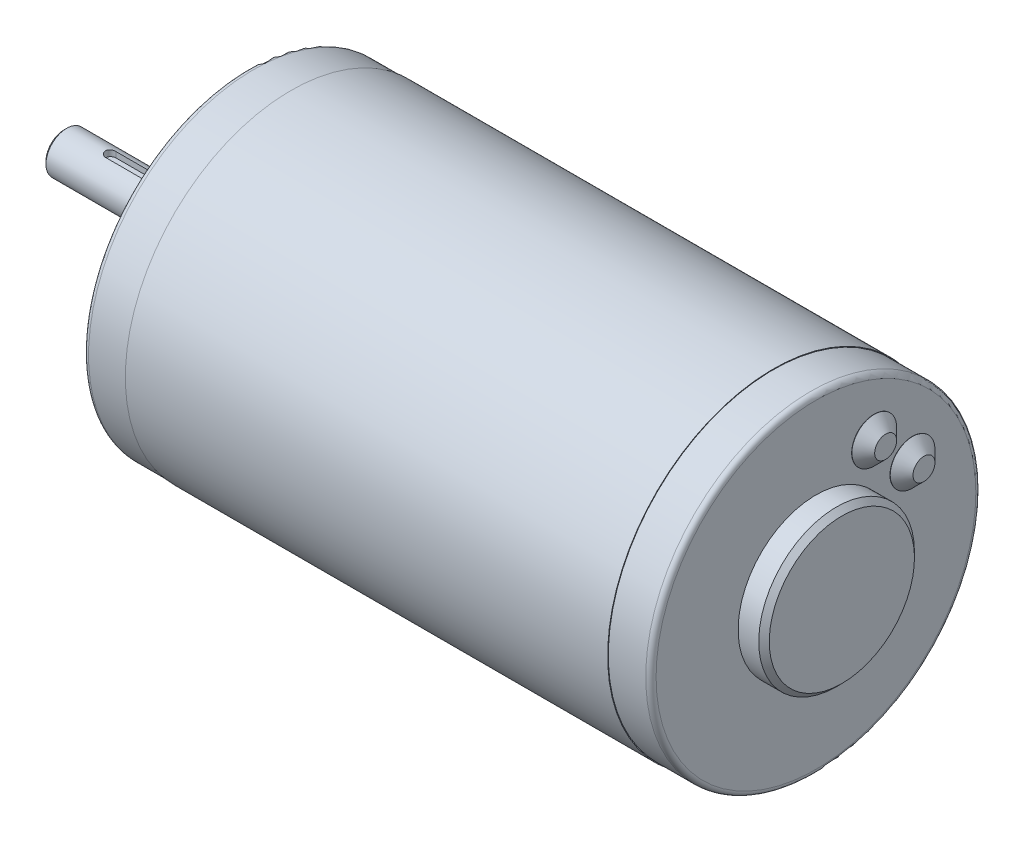
ISO-10303-21;
HEADER;
FILE_DESCRIPTION(('STEP AP214'),'2;1');
FILE_NAME('part.step','',(''),(''),'','','');
FILE_SCHEMA(('AUTOMOTIVE_DESIGN { 1 0 10303 214 1 1 1 1 }'));
ENDSEC;
DATA;
#1=APPLICATION_CONTEXT('core data for automotive mechanical design processes');
#2=APPLICATION_PROTOCOL_DEFINITION('international standard','automotive_design',2000,#1);
#3=PRODUCT_CONTEXT('',#1,'mechanical');
#4=PRODUCT('Part','Part','',(#3));
#5=PRODUCT_RELATED_PRODUCT_CATEGORY('part','',(#4));
#6=PRODUCT_DEFINITION_FORMATION('','',#4);
#7=PRODUCT_DEFINITION_CONTEXT('part definition',#1,'design');
#8=PRODUCT_DEFINITION('design','',#6,#7);
#9=PRODUCT_DEFINITION_SHAPE('','',#8);
#10=(LENGTH_UNIT() NAMED_UNIT(*) SI_UNIT(.MILLI.,.METRE.));
#11=(NAMED_UNIT(*) PLANE_ANGLE_UNIT() SI_UNIT($,.RADIAN.));
#12=(NAMED_UNIT(*) SI_UNIT($,.STERADIAN.) SOLID_ANGLE_UNIT());
#13=UNCERTAINTY_MEASURE_WITH_UNIT(LENGTH_MEASURE(1.E-05),#10,'distance_accuracy_value','');
#14=(GEOMETRIC_REPRESENTATION_CONTEXT(3) GLOBAL_UNCERTAINTY_ASSIGNED_CONTEXT((#13)) GLOBAL_UNIT_ASSIGNED_CONTEXT((#10,
#11,#12)) REPRESENTATION_CONTEXT('',''));
#15=CARTESIAN_POINT('',(0.,0.,0.));
#16=DIRECTION('',(0.,0.,1.));
#17=DIRECTION('',(1.,0.,0.));
#18=AXIS2_PLACEMENT_3D('',#15,#16,#17);
#19=CARTESIAN_POINT('',(-27.6,2.79999999999999,-1.));
#20=DIRECTION('',(0.,-1.,0.));
#21=DIRECTION('',(0.,0.,-1.));
#22=AXIS2_PLACEMENT_3D('',#19,#20,#21);
#23=PLANE('',#22);
#24=CARTESIAN_POINT('',(-7.1,2.79999999999999,0.));
#25=DIRECTION('',(0.,1.,0.));
#26=DIRECTION('',(0.,0.,1.));
#27=AXIS2_PLACEMENT_3D('',#24,#25,#26);
#28=CIRCLE('',#27,1.);
#29=CARTESIAN_POINT('',(-7.1,2.79999999999999,1.));
#30=VERTEX_POINT('',#29);
#31=CARTESIAN_POINT('',(-7.1,2.79999999999999,-1.));
#32=VERTEX_POINT('',#31);
#33=EDGE_CURVE('E80',#30,#32,#28,.T.);
#34=ORIENTED_EDGE('',*,*,#33,.T.);
#35=DIRECTION('',(1.,0.,0.));
#36=VECTOR('',#35,1.);
#37=CARTESIAN_POINT('',(-27.6,2.79999999999999,-1.));
#38=LINE('',#37,#36);
#39=CARTESIAN_POINT('',(-26.6,2.79999999999999,-1.));
#40=VERTEX_POINT('',#39);
#41=EDGE_CURVE('E75',#40,#32,#38,.T.);
#42=ORIENTED_EDGE('',*,*,#41,.F.);
#43=CARTESIAN_POINT('',(-26.6,2.79999999999999,0.));
#44=DIRECTION('',(0.,-1.,0.));
#45=DIRECTION('',(0.,0.,-1.));
#46=AXIS2_PLACEMENT_3D('',#43,#44,#45);
#47=CIRCLE('',#46,1.);
#48=CARTESIAN_POINT('',(-26.6,2.79999999999999,1.));
#49=VERTEX_POINT('',#48);
#50=EDGE_CURVE('E77',#40,#49,#47,.F.);
#51=ORIENTED_EDGE('',*,*,#50,.T.);
#52=DIRECTION('',(1.,0.,0.));
#53=VECTOR('',#52,1.);
#54=CARTESIAN_POINT('',(-27.6,2.79999999999999,1.));
#55=LINE('',#54,#53);
#56=EDGE_CURVE('E103',#49,#30,#55,.T.);
#57=ORIENTED_EDGE('',*,*,#56,.T.);
#58=EDGE_LOOP('',(#34,#42,#51,#57));
#59=FACE_BOUND('',#58,.T.);
#60=ADVANCED_FACE('F17',(#59),#23,.F.);
#61=CARTESIAN_POINT('',(-35.6,0.,0.));
#62=DIRECTION('',(-1.,0.,0.));
#63=DIRECTION('',(0.,0.,1.));
#64=AXIS2_PLACEMENT_3D('',#61,#62,#63);
#65=PLANE('',#64);
#66=CARTESIAN_POINT('',(-35.6000000000449,0.,0.));
#67=DIRECTION('',(1.,0.,0.));
#68=DIRECTION('',(0.,0.,-1.));
#69=AXIS2_PLACEMENT_3D('',#66,#67,#68);
#70=CIRCLE('',#69,3.49999999997408);
#71=CARTESIAN_POINT('',(-35.6000000000449,0.,-3.49999999997408));
#72=VERTEX_POINT('',#71);
#73=EDGE_CURVE('E325',#72,#72,#70,.T.);
#74=ORIENTED_EDGE('',*,*,#73,.F.);
#75=EDGE_LOOP('',(#74));
#76=FACE_BOUND('',#75,.T.);
#77=ADVANCED_FACE('F576',(#76),#65,.T.);
#78=CARTESIAN_POINT('',(-26.6,3.87298334620741,0.));
#79=DIRECTION('',(0.,-1.,0.));
#80=DIRECTION('',(0.,0.,-1.));
#81=AXIS2_PLACEMENT_3D('',#78,#79,#80);
#82=CYLINDRICAL_SURFACE('',#81,1.);
#83=CARTESIAN_POINT('',(-26.6,3.87298334620741,1.));
#84=CARTESIAN_POINT('',(-26.6276629851065,3.87298148580177,1.00000033749611));
#85=CARTESIAN_POINT('',(-26.6553122630182,3.8732800994947,0.998851407375366));
#86=CARTESIAN_POINT('',(-26.7104040353036,3.87445904774558,0.994271295395754));
#87=CARTESIAN_POINT('',(-26.7378465636871,3.87533928441687,0.990840497572679));
#88=CARTESIAN_POINT('',(-26.8194531732088,3.87881710972053,0.977175239382526));
#89=CARTESIAN_POINT('',(-26.8730564684822,3.88225203148808,0.963567695172493));
#90=CARTESIAN_POINT('',(-26.977124673782,3.89095422588002,0.927798076247996));
#91=CARTESIAN_POINT('',(-27.0275898782129,3.89622132630929,0.905636805423835));
#92=CARTESIAN_POINT('',(-27.1241114486473,3.90799134471939,0.853415378025864));
#93=CARTESIAN_POINT('',(-27.170166627891,3.91449459395647,0.823353103356932));
#94=CARTESIAN_POINT('',(-27.2575438819061,3.92816262398025,0.755484471828069));
#95=CARTESIAN_POINT('',(-27.2987548862455,3.93533791028915,0.717537268783975));
#96=CARTESIAN_POINT('',(-27.3743020894827,3.94945104396193,0.635275780516229));
#97=CARTESIAN_POINT('',(-27.4086371894679,3.95638885322537,0.59096047947883));
#98=CARTESIAN_POINT('',(-27.4699110016186,3.96936182283248,0.496456899401689));
#99=CARTESIAN_POINT('',(-27.496739895984,3.9753830468173,0.446195340334472));
#100=CARTESIAN_POINT('',(-27.5415247341967,3.98572346250588,0.341702590842916));
#101=CARTESIAN_POINT('',(-27.5594824242998,3.990042989147,0.287472184083007));
#102=CARTESIAN_POINT('',(-27.5856589927774,3.99641900005128,0.177744108525158));
#103=CARTESIAN_POINT('',(-27.5940676724228,3.998519529013,0.122294322002856));
#104=CARTESIAN_POINT('',(-27.6015033715433,4.00037438150815,0.0107327756816781));
#105=CARTESIAN_POINT('',(-27.6005315701923,4.00012899993444,-0.0453789000287067));
#106=CARTESIAN_POINT('',(-27.5893700363146,3.99735237365735,-0.155352492972096));
#107=CARTESIAN_POINT('',(-27.5793853834005,3.9948719867736,-0.209236701739855));
#108=CARTESIAN_POINT('',(-27.5508113208173,3.98796330636495,-0.31453871108434));
#109=CARTESIAN_POINT('',(-27.5322215304314,3.98353492665556,-0.365956402423988));
#110=CARTESIAN_POINT('',(-27.4867987193294,3.97314997761798,-0.46540728602454));
#111=CARTESIAN_POINT('',(-27.4598926057672,3.96717993827555,-0.513405629602248));
#112=CARTESIAN_POINT('',(-27.3986568701665,3.95435945541919,-0.604276631230015));
#113=CARTESIAN_POINT('',(-27.3643261297468,3.94750887933198,-0.64714851556229));
#114=CARTESIAN_POINT('',(-27.2881210879187,3.93345566022865,-0.727769389708492));
#115=CARTESIAN_POINT('',(-27.2460683634602,3.92624850477685,-0.765349103054128));
#116=CARTESIAN_POINT('',(-27.1561701330723,3.91246168284006,-0.832969575186237));
#117=CARTESIAN_POINT('',(-27.1083230467164,3.90588218842993,-0.863008270245062));
#118=CARTESIAN_POINT('',(-27.0078544021762,3.89407813586325,-0.914804709285961));
#119=CARTESIAN_POINT('',(-26.9552085351039,3.88886106009136,-0.936517017887269));
#120=CARTESIAN_POINT('',(-26.8468830715817,3.88047058807054,-0.970702351849828));
#121=CARTESIAN_POINT('',(-26.7912081448502,3.87729413761435,-0.983189189212131));
#122=CARTESIAN_POINT('',(-26.7125426192411,3.87455290681524,-0.993904635150938));
#123=CARTESIAN_POINT('',(-26.6900802967868,3.87396523110859,-0.996190790966708));
#124=CARTESIAN_POINT('',(-26.6450822100907,3.87318062488974,-0.999236757697394));
#125=CARTESIAN_POINT('',(-26.6225466240447,3.87298306219461,-0.999999038096045));
#126=CARTESIAN_POINT('',(-26.6,3.87298334620741,-1.));
#127=B_SPLINE_CURVE_WITH_KNOTS('',3,(#83,#84,#85,#86,#87,#88,#89,#90,#91,#92,#93,#94,#95,#96,
#97,#98,#99,#100,#101,#102,#103,#104,#105,#106,#107,#108,#109,#110,#111,#112,#113,#114,#115,
#116,#117,#118,#119,#120,#121,#122,#123,#124,#125,#126),.UNSPECIFIED.,.F.,.F.,(4,2,2,2,2,2,2,2,
2,2,2,2,2,2,2,2,2,2,2,2,2,4),(0.,0.0829365303397727,0.165859106084653,0.331229963080318,
0.496585282091499,0.661984974726751,0.830641897427976,0.999325753539196,1.17036187098235,
1.34136430732425,1.50890481515325,1.67642426256639,1.84022545479276,2.00403389475838,
2.16932509450376,2.33464120964329,2.50441429534542,2.67423379180967,2.84496720161068,
3.01544447539986,3.08315848722649,3.15076267731671),.UNSPECIFIED.);
#128=CARTESIAN_POINT('',(-26.6,3.87298334620741,1.));
#129=VERTEX_POINT('',#128);
#130=CARTESIAN_POINT('',(-26.6,3.87298334620741,-1.));
#131=VERTEX_POINT('',#130);
#132=EDGE_CURVE('E161',#129,#131,#127,.T.);
#133=ORIENTED_EDGE('',*,*,#132,.F.);
#134=DIRECTION('',(0.,1.,0.));
#135=VECTOR('',#134,1.);
#136=CARTESIAN_POINT('',(-26.6,2.79999999999999,1.));
#137=LINE('',#136,#135);
#138=EDGE_CURVE('E90',#129,#49,#137,.F.);
#139=ORIENTED_EDGE('',*,*,#138,.T.);
#140=ORIENTED_EDGE('',*,*,#50,.F.);
#141=DIRECTION('',(0.,1.,0.));
#142=VECTOR('',#141,1.);
#143=CARTESIAN_POINT('',(-26.6,2.79999999999999,-1.));
#144=LINE('',#143,#142);
#145=EDGE_CURVE('E84',#131,#40,#144,.F.);
#146=ORIENTED_EDGE('',*,*,#145,.F.);
#147=EDGE_LOOP('',(#133,#139,#140,#146));
#148=FACE_BOUND('',#147,.T.);
#149=ADVANCED_FACE('F87',(#148),#82,.F.);
#150=CARTESIAN_POINT('',(-27.6,2.79999999999999,-1.));
#151=DIRECTION('',(0.,0.,1.));
#152=DIRECTION('',(1.,0.,0.));
#153=AXIS2_PLACEMENT_3D('',#150,#151,#152);
#154=PLANE('',#153);
#155=DIRECTION('',(1.,0.,0.));
#156=VECTOR('',#155,1.);
#157=CARTESIAN_POINT('',(0.,3.87298334620741,-1.));
#158=LINE('',#157,#156);
#159=CARTESIAN_POINT('',(-7.1,3.87298334620741,-1.));
#160=VERTEX_POINT('',#159);
#161=EDGE_CURVE('E95',#131,#160,#158,.T.);
#162=ORIENTED_EDGE('',*,*,#161,.F.);
#163=ORIENTED_EDGE('',*,*,#145,.T.);
#164=ORIENTED_EDGE('',*,*,#41,.T.);
#165=DIRECTION('',(0.,1.,0.));
#166=VECTOR('',#165,1.);
#167=CARTESIAN_POINT('',(-7.1,2.79999999999999,-1.));
#168=LINE('',#167,#166);
#169=EDGE_CURVE('E98',#32,#160,#168,.T.);
#170=ORIENTED_EDGE('',*,*,#169,.T.);
#171=EDGE_LOOP('',(#162,#163,#164,#170));
#172=FACE_BOUND('',#171,.T.);
#173=ADVANCED_FACE('F93',(#172),#154,.T.);
#174=CARTESIAN_POINT('',(-7.1,2.79999999999999,0.));
#175=DIRECTION('',(0.,1.,0.));
#176=DIRECTION('',(0.,0.,1.));
#177=AXIS2_PLACEMENT_3D('',#174,#175,#176);
#178=CYLINDRICAL_SURFACE('',#177,1.);
#179=ORIENTED_EDGE('',*,*,#33,.F.);
#180=DIRECTION('',(0.,1.,0.));
#181=VECTOR('',#180,1.);
#182=CARTESIAN_POINT('',(-7.1,2.79999999999999,1.));
#183=LINE('',#182,#181);
#184=CARTESIAN_POINT('',(-7.1,3.87298334620741,1.));
#185=VERTEX_POINT('',#184);
#186=EDGE_CURVE('E104',#30,#185,#183,.T.);
#187=ORIENTED_EDGE('',*,*,#186,.T.);
#188=CARTESIAN_POINT('',(-7.1,3.87298334620741,-1.));
#189=CARTESIAN_POINT('',(-7.07233701489346,3.87298148580177,-1.00000033749611));
#190=CARTESIAN_POINT('',(-7.04468773698177,3.8732800994947,-0.998851407375366));
#191=CARTESIAN_POINT('',(-6.98959596469644,3.87445904774558,-0.994271295395754));
#192=CARTESIAN_POINT('',(-6.96215343631291,3.87533928441687,-0.990840497572679));
#193=CARTESIAN_POINT('',(-6.88054682679116,3.87881710972053,-0.977175239382526));
#194=CARTESIAN_POINT('',(-6.82694353151779,3.88225203148808,-0.963567695172493));
#195=CARTESIAN_POINT('',(-6.72287532621804,3.89095422588002,-0.927798076247997));
#196=CARTESIAN_POINT('',(-6.67241012178714,3.89622132630929,-0.905636805423836));
#197=CARTESIAN_POINT('',(-6.57588855135267,3.90799134471939,-0.853415378025865));
#198=CARTESIAN_POINT('',(-6.52983337210904,3.91449459395647,-0.823353103356933));
#199=CARTESIAN_POINT('',(-6.4424561180939,3.92816262398025,-0.755484471828069));
#200=CARTESIAN_POINT('',(-6.40124511375448,3.93533791028915,-0.717537268783976));
#201=CARTESIAN_POINT('',(-6.32569791051729,3.94945104396193,-0.63527578051623));
#202=CARTESIAN_POINT('',(-6.29136281053206,3.95638885322537,-0.590960479478831));
#203=CARTESIAN_POINT('',(-6.23008899838136,3.96936182283248,-0.496456899401691));
#204=CARTESIAN_POINT('',(-6.20326010401603,3.9753830468173,-0.446195340334474));
#205=CARTESIAN_POINT('',(-6.1584752658033,3.98572346250588,-0.341702590842919));
#206=CARTESIAN_POINT('',(-6.14051757570017,3.990042989147,-0.28747218408301));
#207=CARTESIAN_POINT('',(-6.11434100722257,3.99641900005128,-0.17774410852516));
#208=CARTESIAN_POINT('',(-6.10593232757718,3.998519529013,-0.122294322002858));
#209=CARTESIAN_POINT('',(-6.09849662845671,4.00037438150815,-0.0107327756816796));
#210=CARTESIAN_POINT('',(-6.09946842980766,4.00012899993444,0.0453789000287057));
#211=CARTESIAN_POINT('',(-6.11062996368545,3.99735237365735,0.155352492972096));
#212=CARTESIAN_POINT('',(-6.12061461659948,3.9948719867736,0.209236701739855));
#213=CARTESIAN_POINT('',(-6.14918867918275,3.98796330636495,0.31453871108434));
#214=CARTESIAN_POINT('',(-6.16777846956858,3.98353492665556,0.365956402423988));
#215=CARTESIAN_POINT('',(-6.21320128067065,3.97314997761798,0.465407286024539));
#216=CARTESIAN_POINT('',(-6.24010739423284,3.96717993827555,0.513405629602248));
#217=CARTESIAN_POINT('',(-6.30134312983347,3.95435945541919,0.604276631230014));
#218=CARTESIAN_POINT('',(-6.33567387025322,3.94750887933198,0.647148515562289));
#219=CARTESIAN_POINT('',(-6.41187891208131,3.93345566022865,0.72776938970849));
#220=CARTESIAN_POINT('',(-6.45393163653981,3.92624850477685,0.765349103054127));
#221=CARTESIAN_POINT('',(-6.54382986692773,3.91246168284006,0.832969575186237));
#222=CARTESIAN_POINT('',(-6.59167695328356,3.90588218842993,0.863008270245062));
#223=CARTESIAN_POINT('',(-6.69214559782377,3.89407813586325,0.914804709285962));
#224=CARTESIAN_POINT('',(-6.74479146489609,3.88886106009136,0.936517017887269));
#225=CARTESIAN_POINT('',(-6.85311692841829,3.88047058807055,0.970702351849829));
#226=CARTESIAN_POINT('',(-6.90879185514984,3.87729413761435,0.983189189212132));
#227=CARTESIAN_POINT('',(-6.9874573807589,3.87455290681524,0.993904635150938));
#228=CARTESIAN_POINT('',(-7.00991970321318,3.87396523110859,0.996190790966708));
#229=CARTESIAN_POINT('',(-7.05491778990932,3.87318062488974,0.999236757697394));
#230=CARTESIAN_POINT('',(-7.07745337595529,3.87298306219461,0.999999038096045));
#231=CARTESIAN_POINT('',(-7.1,3.87298334620741,1.));
#232=B_SPLINE_CURVE_WITH_KNOTS('',3,(#188,#189,#190,#191,#192,#193,#194,#195,#196,#197,#198,
#199,#200,#201,#202,#203,#204,#205,#206,#207,#208,#209,#210,#211,#212,#213,#214,#215,#216,#217,
#218,#219,#220,#221,#222,#223,#224,#225,#226,#227,#228,#229,#230,#231),.UNSPECIFIED.,.F.,.F.,(4,
2,2,2,2,2,2,2,2,2,2,2,2,2,2,2,2,2,2,2,2,4),(0.,0.0829365303397693,0.165859106084651,
0.331229963080317,0.496585282091498,0.661984974726749,0.830641897427974,0.999325753539193,
1.17036187098235,1.34136430732424,1.50890481515325,1.67642426256639,1.84022545479276,
2.00403389475838,2.16932509450376,2.33464120964329,2.50441429534542,2.67423379180967,
2.84496720161068,3.01544447539986,3.08315848722648,3.15076267731671),.UNSPECIFIED.);
#233=EDGE_CURVE('E152',#160,#185,#232,.T.);
#234=ORIENTED_EDGE('',*,*,#233,.F.);
#235=ORIENTED_EDGE('',*,*,#169,.F.);
#236=EDGE_LOOP('',(#179,#187,#234,#235));
#237=FACE_BOUND('',#236,.T.);
#238=ADVANCED_FACE('F167',(#237),#178,.F.);
#239=CARTESIAN_POINT('',(-27.6,2.79999999999999,1.));
#240=DIRECTION('',(0.,0.,1.));
#241=DIRECTION('',(1.,0.,0.));
#242=AXIS2_PLACEMENT_3D('',#239,#240,#241);
#243=PLANE('',#242);
#244=ORIENTED_EDGE('',*,*,#186,.F.);
#245=ORIENTED_EDGE('',*,*,#56,.F.);
#246=ORIENTED_EDGE('',*,*,#138,.F.);
#247=DIRECTION('',(1.,0.,0.));
#248=VECTOR('',#247,1.);
#249=CARTESIAN_POINT('',(0.,3.87298334620741,1.));
#250=LINE('',#249,#248);
#251=EDGE_CURVE('E160',#185,#129,#250,.F.);
#252=ORIENTED_EDGE('',*,*,#251,.F.);
#253=EDGE_LOOP('',(#244,#245,#246,#252));
#254=FACE_BOUND('',#253,.T.);
#255=ADVANCED_FACE('F182',(#254),#243,.F.);
#256=CARTESIAN_POINT('',(-35.0999999999999,0.,0.));
#257=DIRECTION('',(1.,0.,0.));
#258=DIRECTION('',(0.,0.,-1.));
#259=AXIS2_PLACEMENT_3D('',#256,#257,#258);
#260=CONICAL_SURFACE('',#259,3.99999999996226,0.785398163340605);
#261=ORIENTED_EDGE('',*,*,#73,.T.);
#262=EDGE_LOOP('',(#261));
#263=FACE_BOUND('',#262,.T.);
#264=CARTESIAN_POINT('',(-35.1,0.,0.));
#265=DIRECTION('',(1.,0.,0.));
#266=DIRECTION('',(0.,0.,-1.));
#267=AXIS2_PLACEMENT_3D('',#264,#265,#266);
#268=CIRCLE('',#267,4.);
#269=CARTESIAN_POINT('',(-35.1,0.,-4.));
#270=VERTEX_POINT('',#269);
#271=EDGE_CURVE('E151',#270,#270,#268,.T.);
#272=ORIENTED_EDGE('',*,*,#271,.F.);
#273=EDGE_LOOP('',(#272));
#274=FACE_BOUND('',#273,.T.);
#275=ADVANCED_FACE('F177',(#263,#274),#260,.T.);
#276=CARTESIAN_POINT('',(0.,0.,0.));
#277=DIRECTION('',(1.,0.,0.));
#278=DIRECTION('',(0.,0.,-1.));
#279=AXIS2_PLACEMENT_3D('',#276,#277,#278);
#280=CYLINDRICAL_SURFACE('',#279,4.);
#281=ORIENTED_EDGE('',*,*,#271,.T.);
#282=EDGE_LOOP('',(#281));
#283=FACE_BOUND('',#282,.T.);
#284=CARTESIAN_POINT('',(-4.,0.,0.));
#285=DIRECTION('',(1.,0.,0.));
#286=DIRECTION('',(0.,0.,-1.));
#287=AXIS2_PLACEMENT_3D('',#284,#285,#286);
#288=CIRCLE('',#287,4.);
#289=CARTESIAN_POINT('',(-4.,0.,-4.));
#290=VERTEX_POINT('',#289);
#291=EDGE_CURVE('E148',#290,#290,#288,.T.);
#292=ORIENTED_EDGE('',*,*,#291,.F.);
#293=EDGE_LOOP('',(#292));
#294=FACE_BOUND('',#293,.T.);
#295=ORIENTED_EDGE('',*,*,#233,.T.);
#296=ORIENTED_EDGE('',*,*,#251,.T.);
#297=ORIENTED_EDGE('',*,*,#132,.T.);
#298=ORIENTED_EDGE('',*,*,#161,.T.);
#299=EDGE_LOOP('',(#295,#296,#297,#298));
#300=FACE_BOUND('',#299,.T.);
#301=ADVANCED_FACE('F171',(#283,#294,#300),#280,.T.);
#302=CARTESIAN_POINT('',(-4.,4.,0.));
#303=DIRECTION('',(-1.,0.,0.));
#304=DIRECTION('',(0.,0.,1.));
#305=AXIS2_PLACEMENT_3D('',#302,#303,#304);
#306=PLANE('',#305);
#307=ORIENTED_EDGE('',*,*,#291,.T.);
#308=EDGE_LOOP('',(#307));
#309=FACE_BOUND('',#308,.T.);
#310=CARTESIAN_POINT('',(-4.,0.,0.));
#311=DIRECTION('',(1.,0.,0.));
#312=DIRECTION('',(0.,1.,0.));
#313=AXIS2_PLACEMENT_3D('',#310,#311,#312);
#314=CIRCLE('',#313,8.509);
#315=CARTESIAN_POINT('',(-4.,8.509,0.));
#316=VERTEX_POINT('',#315);
#317=EDGE_CURVE('E145',#316,#316,#314,.T.);
#318=ORIENTED_EDGE('',*,*,#317,.F.);
#319=EDGE_LOOP('',(#318));
#320=FACE_BOUND('',#319,.T.);
#321=ADVANCED_FACE('F176',(#309,#320),#306,.T.);
#322=CARTESIAN_POINT('',(111.8479,18.6070906828553,-11.2073596390943));
#323=DIRECTION('',(1.,0.,0.));
#324=DIRECTION('',(0.,0.,-1.));
#325=AXIS2_PLACEMENT_3D('',#322,#323,#324);
#326=PLANE('',#325);
#327=CARTESIAN_POINT('',(111.84789999993,18.6070906828553,-11.2073596390943));
#328=DIRECTION('',(-1.,0.,0.));
#329=DIRECTION('',(0.,-1.,0.));
#330=AXIS2_PLACEMENT_3D('',#327,#328,#329);
#331=CIRCLE('',#330,2.11800000003146);
#332=CARTESIAN_POINT('',(111.84789999993,16.4890906828238,-11.2073596390943));
#333=VERTEX_POINT('',#332);
#334=EDGE_CURVE('E142',#333,#333,#331,.T.);
#335=ORIENTED_EDGE('',*,*,#334,.F.);
#336=EDGE_LOOP('',(#335));
#337=FACE_BOUND('',#336,.T.);
#338=ADVANCED_FACE('F528',(#337),#326,.T.);
#339=CARTESIAN_POINT('',(114.6,15.0368,0.));
#340=DIRECTION('',(1.,0.,0.));
#341=DIRECTION('',(0.,0.,-1.));
#342=AXIS2_PLACEMENT_3D('',#339,#340,#341);
#343=PLANE('',#342);
#344=CARTESIAN_POINT('',(114.6,0.,0.));
#345=DIRECTION('',(-1.,0.,0.));
#346=DIRECTION('',(0.,-1.,0.));
#347=AXIS2_PLACEMENT_3D('',#344,#345,#346);
#348=CIRCLE('',#347,14.0208);
#349=CARTESIAN_POINT('',(114.6,-14.0208,0.));
#350=VERTEX_POINT('',#349);
#351=EDGE_CURVE('E139',#350,#350,#348,.T.);
#352=ORIENTED_EDGE('',*,*,#351,.F.);
#353=EDGE_LOOP('',(#352));
#354=FACE_BOUND('',#353,.T.);
#355=ADVANCED_FACE('F519',(#354),#343,.T.);
#356=CARTESIAN_POINT('',(111.8479,11.2073596390943,-18.6070906828553));
#357=DIRECTION('',(1.,0.,0.));
#358=DIRECTION('',(0.,0.,-1.));
#359=AXIS2_PLACEMENT_3D('',#356,#357,#358);
#360=PLANE('',#359);
#361=CARTESIAN_POINT('',(111.84789999993,11.2073596390943,-18.6070906828553));
#362=DIRECTION('',(-1.,0.,0.));
#363=DIRECTION('',(0.,0.,1.));
#364=AXIS2_PLACEMENT_3D('',#361,#362,#363);
#365=CIRCLE('',#364,2.1180000000021);
#366=CARTESIAN_POINT('',(111.84789999993,11.2073596390943,-16.4890906828532));
#367=VERTEX_POINT('',#366);
#368=EDGE_CURVE('E135',#367,#367,#365,.T.);
#369=ORIENTED_EDGE('',*,*,#368,.F.);
#370=EDGE_LOOP('',(#369));
#371=FACE_BOUND('',#370,.T.);
#372=ADVANCED_FACE('F510',(#371),#360,.T.);
#373=CARTESIAN_POINT('',(13.6143999999945,25.4,0.));
#374=DIRECTION('',(-1.,0.,0.));
#375=DIRECTION('',(0.,0.,1.));
#376=AXIS2_PLACEMENT_3D('',#373,#374,#375);
#377=CONICAL_SURFACE('',#376,2.01929999997219,1.02974425867198);
#378=CARTESIAN_POINT('',(14.827717847993,25.4,0.));
#379=VERTEX_POINT('',#378);
#380=VERTEX_LOOP('',#379);
#381=FACE_BOUND('',#380,.T.);
#382=CARTESIAN_POINT('',(13.6144,25.4,0.));
#383=DIRECTION('',(-1.,0.,0.));
#384=DIRECTION('',(0.,0.,1.));
#385=AXIS2_PLACEMENT_3D('',#382,#383,#384);
#386=CIRCLE('',#385,2.0193);
#387=CARTESIAN_POINT('',(13.6144,25.4,2.0193));
#388=VERTEX_POINT('',#387);
#389=EDGE_CURVE('E138',#388,#388,#386,.T.);
#390=ORIENTED_EDGE('',*,*,#389,.T.);
#391=EDGE_LOOP('',(#390));
#392=FACE_BOUND('',#391,.T.);
#393=ADVANCED_FACE('F501',(#381,#392),#377,.F.);
#394=CARTESIAN_POINT('',(13.6143999999945,-25.4,0.));
#395=DIRECTION('',(-1.,0.,0.));
#396=DIRECTION('',(0.,0.,1.));
#397=AXIS2_PLACEMENT_3D('',#394,#395,#396);
#398=CONICAL_SURFACE('',#397,2.01929999997219,1.02974425867198);
#399=CARTESIAN_POINT('',(14.827717847993,-25.4,0.));
#400=VERTEX_POINT('',#399);
#401=VERTEX_LOOP('',#400);
#402=FACE_BOUND('',#401,.T.);
#403=CARTESIAN_POINT('',(13.6144,-25.4,0.));
#404=DIRECTION('',(-1.,0.,0.));
#405=DIRECTION('',(0.,0.,1.));
#406=AXIS2_PLACEMENT_3D('',#403,#404,#405);
#407=CIRCLE('',#406,2.0193);
#408=CARTESIAN_POINT('',(13.6144,-25.4,2.0193));
#409=VERTEX_POINT('',#408);
#410=EDGE_CURVE('E315',#409,#409,#407,.T.);
#411=ORIENTED_EDGE('',*,*,#410,.T.);
#412=EDGE_LOOP('',(#411));
#413=FACE_BOUND('',#412,.T.);
#414=ADVANCED_FACE('F492',(#402,#413),#398,.F.);
#415=CARTESIAN_POINT('',(-2.984,0.,0.));
#416=DIRECTION('',(1.,0.,0.));
#417=DIRECTION('',(0.,1.,0.));
#418=AXIS2_PLACEMENT_3D('',#415,#416,#417);
#419=CONICAL_SURFACE('',#418,9.525,0.78539816339745);
#420=ORIENTED_EDGE('',*,*,#317,.T.);
#421=EDGE_LOOP('',(#420));
#422=FACE_BOUND('',#421,.T.);
#423=CARTESIAN_POINT('',(-2.984,0.,0.));
#424=DIRECTION('',(1.,0.,0.));
#425=DIRECTION('',(0.,0.,-1.));
#426=AXIS2_PLACEMENT_3D('',#423,#424,#425);
#427=CIRCLE('',#426,9.525);
#428=CARTESIAN_POINT('',(-2.984,0.,-9.525));
#429=VERTEX_POINT('',#428);
#430=EDGE_CURVE('E312',#429,#429,#427,.T.);
#431=ORIENTED_EDGE('',*,*,#430,.F.);
#432=EDGE_LOOP('',(#431));
#433=FACE_BOUND('',#432,.T.);
#434=ADVANCED_FACE('F483',(#422,#433),#419,.T.);
#435=CARTESIAN_POINT('',(109.647900000027,18.6070906828553,-11.2073596390943));
#436=DIRECTION('',(-1.,0.,0.));
#437=DIRECTION('',(0.,-1.,0.));
#438=AXIS2_PLACEMENT_3D('',#435,#436,#437);
#439=CONICAL_SURFACE('',#438,4.31799999987712,0.785398163384529);
#440=CARTESIAN_POINT('',(109.6479,18.6070906828553,-11.2073596390943));
#441=DIRECTION('',(-1.,0.,0.));
#442=DIRECTION('',(0.,0.,1.));
#443=AXIS2_PLACEMENT_3D('',#440,#441,#442);
#444=CIRCLE('',#443,4.318);
#445=CARTESIAN_POINT('',(109.6479,18.6070906828553,-6.88935963909434));
#446=VERTEX_POINT('',#445);
#447=EDGE_CURVE('E309',#446,#446,#444,.T.);
#448=ORIENTED_EDGE('',*,*,#447,.F.);
#449=EDGE_LOOP('',(#448));
#450=FACE_BOUND('',#449,.T.);
#451=ORIENTED_EDGE('',*,*,#334,.T.);
#452=EDGE_LOOP('',(#451));
#453=FACE_BOUND('',#452,.T.);
#454=ADVANCED_FACE('F474',(#450,#453),#439,.T.);
#455=CARTESIAN_POINT('',(113.584,0.,0.));
#456=DIRECTION('',(-1.,0.,0.));
#457=DIRECTION('',(0.,-1.,0.));
#458=AXIS2_PLACEMENT_3D('',#455,#456,#457);
#459=CONICAL_SURFACE('',#458,15.0368,0.785398163397441);
#460=ORIENTED_EDGE('',*,*,#351,.T.);
#461=EDGE_LOOP('',(#460));
#462=FACE_BOUND('',#461,.T.);
#463=CARTESIAN_POINT('',(113.584,0.,0.));
#464=DIRECTION('',(1.,0.,0.));
#465=DIRECTION('',(0.,0.,-1.));
#466=AXIS2_PLACEMENT_3D('',#463,#464,#465);
#467=CIRCLE('',#466,15.0368);
#468=CARTESIAN_POINT('',(113.584,0.,-15.0368));
#469=VERTEX_POINT('',#468);
#470=EDGE_CURVE('E306',#469,#469,#467,.F.);
#471=ORIENTED_EDGE('',*,*,#470,.F.);
#472=EDGE_LOOP('',(#471));
#473=FACE_BOUND('',#472,.T.);
#474=ADVANCED_FACE('F465',(#462,#473),#459,.T.);
#475=CARTESIAN_POINT('',(109.647900000084,11.2073596390943,-18.6070906828553));
#476=DIRECTION('',(-1.,0.,0.));
#477=DIRECTION('',(0.,0.,1.));
#478=AXIS2_PLACEMENT_3D('',#475,#476,#477);
#479=CONICAL_SURFACE('',#478,4.31799999990461,0.785398163410367);
#480=CARTESIAN_POINT('',(109.6479,11.2073596390943,-18.6070906828553));
#481=DIRECTION('',(-1.,0.,0.));
#482=DIRECTION('',(0.,0.,1.));
#483=AXIS2_PLACEMENT_3D('',#480,#481,#482);
#484=CIRCLE('',#483,4.318);
#485=CARTESIAN_POINT('',(109.6479,11.2073596390943,-14.2890906828553));
#486=VERTEX_POINT('',#485);
#487=EDGE_CURVE('E134',#486,#486,#484,.T.);
#488=ORIENTED_EDGE('',*,*,#487,.F.);
#489=EDGE_LOOP('',(#488));
#490=FACE_BOUND('',#489,.T.);
#491=ORIENTED_EDGE('',*,*,#368,.T.);
#492=EDGE_LOOP('',(#491));
#493=FACE_BOUND('',#492,.T.);
#494=ADVANCED_FACE('F456',(#490,#493),#479,.T.);
#495=CARTESIAN_POINT('',(0.,25.4,0.));
#496=DIRECTION('',(-1.,0.,0.));
#497=DIRECTION('',(0.,0.,1.));
#498=AXIS2_PLACEMENT_3D('',#495,#496,#497);
#499=CYLINDRICAL_SURFACE('',#498,2.0193);
#500=CARTESIAN_POINT('',(0.,25.4,0.));
#501=DIRECTION('',(-1.,0.,0.));
#502=DIRECTION('',(0.,0.,1.));
#503=AXIS2_PLACEMENT_3D('',#500,#501,#502);
#504=CIRCLE('',#503,2.0193);
#505=CARTESIAN_POINT('',(0.,25.4,2.0193));
#506=VERTEX_POINT('',#505);
#507=EDGE_CURVE('E131',#506,#506,#504,.F.);
#508=ORIENTED_EDGE('',*,*,#507,.F.);
#509=EDGE_LOOP('',(#508));
#510=FACE_BOUND('',#509,.T.);
#511=ORIENTED_EDGE('',*,*,#389,.F.);
#512=EDGE_LOOP('',(#511));
#513=FACE_BOUND('',#512,.T.);
#514=ADVANCED_FACE('F447',(#510,#513),#499,.F.);
#515=CARTESIAN_POINT('',(0.,-25.4,0.));
#516=DIRECTION('',(-1.,0.,0.));
#517=DIRECTION('',(0.,0.,1.));
#518=AXIS2_PLACEMENT_3D('',#515,#516,#517);
#519=CYLINDRICAL_SURFACE('',#518,2.0193);
#520=CARTESIAN_POINT('',(0.,-25.4,0.));
#521=DIRECTION('',(-1.,0.,0.));
#522=DIRECTION('',(0.,0.,1.));
#523=AXIS2_PLACEMENT_3D('',#520,#521,#522);
#524=CIRCLE('',#523,2.0193);
#525=CARTESIAN_POINT('',(0.,-25.4,2.0193));
#526=VERTEX_POINT('',#525);
#527=EDGE_CURVE('E128',#526,#526,#524,.F.);
#528=ORIENTED_EDGE('',*,*,#527,.F.);
#529=EDGE_LOOP('',(#528));
#530=FACE_BOUND('',#529,.T.);
#531=ORIENTED_EDGE('',*,*,#410,.F.);
#532=EDGE_LOOP('',(#531));
#533=FACE_BOUND('',#532,.T.);
#534=ADVANCED_FACE('F438',(#530,#533),#519,.F.);
#535=CARTESIAN_POINT('',(0.,0.,0.));
#536=DIRECTION('',(1.,0.,0.));
#537=DIRECTION('',(0.,0.,-1.));
#538=AXIS2_PLACEMENT_3D('',#535,#536,#537);
#539=CYLINDRICAL_SURFACE('',#538,9.525);
#540=ORIENTED_EDGE('',*,*,#430,.T.);
#541=EDGE_LOOP('',(#540));
#542=FACE_BOUND('',#541,.T.);
#543=CARTESIAN_POINT('',(0.,0.,0.));
#544=DIRECTION('',(1.,0.,0.));
#545=DIRECTION('',(0.,0.,-1.));
#546=AXIS2_PLACEMENT_3D('',#543,#544,#545);
#547=CIRCLE('',#546,9.525);
#548=CARTESIAN_POINT('',(0.,0.,-9.525));
#549=VERTEX_POINT('',#548);
#550=EDGE_CURVE('E125',#549,#549,#547,.T.);
#551=ORIENTED_EDGE('',*,*,#550,.F.);
#552=EDGE_LOOP('',(#551));
#553=FACE_BOUND('',#552,.T.);
#554=ADVANCED_FACE('F429',(#542,#553),#539,.T.);
#555=CARTESIAN_POINT('',(111.8479,18.6070906828553,-11.2073596390943));
#556=DIRECTION('',(-1.,0.,0.));
#557=DIRECTION('',(0.,0.,1.));
#558=AXIS2_PLACEMENT_3D('',#555,#556,#557);
#559=CYLINDRICAL_SURFACE('',#558,4.318);
#560=CARTESIAN_POINT('',(109.6,18.6070906828553,-11.2073596390943));
#561=DIRECTION('',(-1.,0.,0.));
#562=DIRECTION('',(0.,0.,1.));
#563=AXIS2_PLACEMENT_3D('',#560,#561,#562);
#564=CIRCLE('',#563,4.318);
#565=CARTESIAN_POINT('',(109.6,18.6070906828553,-6.88935963909434));
#566=VERTEX_POINT('',#565);
#567=EDGE_CURVE('E122',#566,#566,#564,.T.);
#568=ORIENTED_EDGE('',*,*,#567,.F.);
#569=EDGE_LOOP('',(#568));
#570=FACE_BOUND('',#569,.T.);
#571=ORIENTED_EDGE('',*,*,#447,.T.);
#572=EDGE_LOOP('',(#571));
#573=FACE_BOUND('',#572,.T.);
#574=ADVANCED_FACE('F420',(#570,#573),#559,.T.);
#575=CARTESIAN_POINT('',(0.,0.,0.));
#576=DIRECTION('',(1.,0.,0.));
#577=DIRECTION('',(0.,0.,-1.));
#578=AXIS2_PLACEMENT_3D('',#575,#576,#577);
#579=CYLINDRICAL_SURFACE('',#578,15.0368);
#580=CARTESIAN_POINT('',(109.6,0.,0.));
#581=DIRECTION('',(1.,0.,0.));
#582=DIRECTION('',(0.,0.,-1.));
#583=AXIS2_PLACEMENT_3D('',#580,#581,#582);
#584=CIRCLE('',#583,15.0368);
#585=CARTESIAN_POINT('',(109.6,0.,-15.0368));
#586=VERTEX_POINT('',#585);
#587=EDGE_CURVE('E119',#586,#586,#584,.F.);
#588=ORIENTED_EDGE('',*,*,#587,.F.);
#589=EDGE_LOOP('',(#588));
#590=FACE_BOUND('',#589,.T.);
#591=ORIENTED_EDGE('',*,*,#470,.T.);
#592=EDGE_LOOP('',(#591));
#593=FACE_BOUND('',#592,.T.);
#594=ADVANCED_FACE('F412',(#590,#593),#579,.T.);
#595=CARTESIAN_POINT('',(111.8479,11.2073596390943,-18.6070906828553));
#596=DIRECTION('',(-1.,0.,0.));
#597=DIRECTION('',(0.,0.,1.));
#598=AXIS2_PLACEMENT_3D('',#595,#596,#597);
#599=CYLINDRICAL_SURFACE('',#598,4.318);
#600=CARTESIAN_POINT('',(109.6,11.2073596390943,-18.6070906828553));
#601=DIRECTION('',(-1.,0.,0.));
#602=DIRECTION('',(0.,0.,1.));
#603=AXIS2_PLACEMENT_3D('',#600,#601,#602);
#604=CIRCLE('',#603,4.318);
#605=CARTESIAN_POINT('',(109.6,11.2073596390943,-14.2890906828553));
#606=VERTEX_POINT('',#605);
#607=EDGE_CURVE('E115',#606,#606,#604,.T.);
#608=ORIENTED_EDGE('',*,*,#607,.F.);
#609=EDGE_LOOP('',(#608));
#610=FACE_BOUND('',#609,.T.);
#611=ORIENTED_EDGE('',*,*,#487,.T.);
#612=EDGE_LOOP('',(#611));
#613=FACE_BOUND('',#612,.T.);
#614=ADVANCED_FACE('F404',(#610,#613),#599,.T.);
#615=CARTESIAN_POINT('',(0.,9.525,0.));
#616=DIRECTION('',(-1.,0.,0.));
#617=DIRECTION('',(0.,0.,1.));
#618=AXIS2_PLACEMENT_3D('',#615,#616,#617);
#619=PLANE('',#618);
#620=ORIENTED_EDGE('',*,*,#550,.T.);
#621=EDGE_LOOP('',(#620));
#622=FACE_BOUND('',#621,.T.);
#623=CARTESIAN_POINT('',(0.,0.,0.));
#624=DIRECTION('',(1.,0.,0.));
#625=DIRECTION('',(0.,0.,-1.));
#626=AXIS2_PLACEMENT_3D('',#623,#624,#625);
#627=CIRCLE('',#626,30.877);
#628=CARTESIAN_POINT('',(0.,0.,-30.877));
#629=VERTEX_POINT('',#628);
#630=CARTESIAN_POINT('',(0.,0.,30.877));
#631=VERTEX_POINT('',#630);
#632=EDGE_CURVE('E118',#629,#631,#627,.T.);
#633=ORIENTED_EDGE('',*,*,#632,.F.);
#634=CARTESIAN_POINT('',(0.,0.,0.));
#635=DIRECTION('',(1.,0.,0.));
#636=DIRECTION('',(0.,0.,1.));
#637=AXIS2_PLACEMENT_3D('',#634,#635,#636);
#638=CIRCLE('',#637,30.877);
#639=EDGE_CURVE('E285',#631,#629,#638,.T.);
#640=ORIENTED_EDGE('',*,*,#639,.F.);
#641=EDGE_LOOP('',(#633,#640));
#642=FACE_BOUND('',#641,.T.);
#643=ORIENTED_EDGE('',*,*,#527,.T.);
#644=EDGE_LOOP('',(#643));
#645=FACE_BOUND('',#644,.T.);
#646=ORIENTED_EDGE('',*,*,#507,.T.);
#647=EDGE_LOOP('',(#646));
#648=FACE_BOUND('',#647,.T.);
#649=ADVANCED_FACE('F251',(#622,#642,#645,#648),#619,.T.);
#650=CARTESIAN_POINT('',(109.6,31.877,0.));
#651=DIRECTION('',(1.,0.,0.));
#652=DIRECTION('',(0.,0.,-1.));
#653=AXIS2_PLACEMENT_3D('',#650,#651,#652);
#654=PLANE('',#653);
#655=ORIENTED_EDGE('',*,*,#607,.T.);
#656=EDGE_LOOP('',(#655));
#657=FACE_BOUND('',#656,.T.);
#658=ORIENTED_EDGE('',*,*,#587,.T.);
#659=EDGE_LOOP('',(#658));
#660=FACE_BOUND('',#659,.T.);
#661=CARTESIAN_POINT('',(109.6,0.,0.));
#662=DIRECTION('',(-1.,0.,0.));
#663=DIRECTION('',(0.,0.,1.));
#664=AXIS2_PLACEMENT_3D('',#661,#662,#663);
#665=CIRCLE('',#664,30.877);
#666=CARTESIAN_POINT('',(109.6,0.,30.877));
#667=VERTEX_POINT('',#666);
#668=CARTESIAN_POINT('',(109.6,0.,-30.877));
#669=VERTEX_POINT('',#668);
#670=EDGE_CURVE('E36',#667,#669,#665,.T.);
#671=ORIENTED_EDGE('',*,*,#670,.F.);
#672=CARTESIAN_POINT('',(109.6,0.,0.));
#673=DIRECTION('',(-1.,0.,0.));
#674=DIRECTION('',(0.,0.,-1.));
#675=AXIS2_PLACEMENT_3D('',#672,#673,#674);
#676=CIRCLE('',#675,30.877);
#677=EDGE_CURVE('E233',#669,#667,#676,.T.);
#678=ORIENTED_EDGE('',*,*,#677,.F.);
#679=EDGE_LOOP('',(#671,#678));
#680=FACE_BOUND('',#679,.T.);
#681=ORIENTED_EDGE('',*,*,#567,.T.);
#682=EDGE_LOOP('',(#681));
#683=FACE_BOUND('',#682,.T.);
#684=ADVANCED_FACE('F242',(#657,#660,#680,#683),#654,.T.);
#685=CARTESIAN_POINT('',(0.999999999999999,0.,0.));
#686=DIRECTION('',(-1.,0.,0.));
#687=DIRECTION('',(0.,0.,1.));
#688=AXIS2_PLACEMENT_3D('',#685,#686,#687);
#689=TOROIDAL_SURFACE('',#688,30.877,1.);
#690=CARTESIAN_POINT('',(0.999999999999999,0.,0.));
#691=DIRECTION('',(1.,0.,0.));
#692=DIRECTION('',(0.,0.,-1.));
#693=AXIS2_PLACEMENT_3D('',#690,#691,#692);
#694=CIRCLE('',#693,31.877);
#695=CARTESIAN_POINT('',(0.999999999999999,0.,-31.877));
#696=VERTEX_POINT('',#695);
#697=EDGE_CURVE('E231',#696,#696,#694,.T.);
#698=ORIENTED_EDGE('',*,*,#697,.F.);
#699=EDGE_LOOP('',(#698));
#700=FACE_BOUND('',#699,.T.);
#701=ORIENTED_EDGE('',*,*,#639,.T.);
#702=ORIENTED_EDGE('',*,*,#632,.T.);
#703=EDGE_LOOP('',(#701,#702));
#704=FACE_BOUND('',#703,.T.);
#705=ADVANCED_FACE('F220',(#700,#704),#689,.T.);
#706=CARTESIAN_POINT('',(108.6,0.,0.));
#707=DIRECTION('',(1.,0.,0.));
#708=DIRECTION('',(0.,0.,-1.));
#709=AXIS2_PLACEMENT_3D('',#706,#707,#708);
#710=TOROIDAL_SURFACE('',#709,30.877,1.);
#711=CARTESIAN_POINT('',(108.6,0.,0.));
#712=DIRECTION('',(1.,0.,0.));
#713=DIRECTION('',(0.,0.,-1.));
#714=AXIS2_PLACEMENT_3D('',#711,#712,#713);
#715=CIRCLE('',#714,31.877);
#716=CARTESIAN_POINT('',(108.6,0.,-31.877));
#717=VERTEX_POINT('',#716);
#718=EDGE_CURVE('E114',#717,#717,#715,.F.);
#719=ORIENTED_EDGE('',*,*,#718,.F.);
#720=EDGE_LOOP('',(#719));
#721=FACE_BOUND('',#720,.T.);
#722=ORIENTED_EDGE('',*,*,#677,.T.);
#723=ORIENTED_EDGE('',*,*,#670,.T.);
#724=EDGE_LOOP('',(#722,#723));
#725=FACE_BOUND('',#724,.T.);
#726=ADVANCED_FACE('F215',(#721,#725),#710,.T.);
#727=CARTESIAN_POINT('',(0.,0.,0.));
#728=DIRECTION('',(1.,0.,0.));
#729=DIRECTION('',(0.,0.,-1.));
#730=AXIS2_PLACEMENT_3D('',#727,#728,#729);
#731=CYLINDRICAL_SURFACE('',#730,31.877);
#732=ORIENTED_EDGE('',*,*,#697,.T.);
#733=EDGE_LOOP('',(#732));
#734=FACE_BOUND('',#733,.T.);
#735=CARTESIAN_POINT('',(8.2296,0.,0.));
#736=DIRECTION('',(1.,0.,0.));
#737=DIRECTION('',(0.,0.,-1.));
#738=AXIS2_PLACEMENT_3D('',#735,#736,#737);
#739=CIRCLE('',#738,31.877);
#740=CARTESIAN_POINT('',(8.2296,0.,-31.877));
#741=VERTEX_POINT('',#740);
#742=EDGE_CURVE('E111',#741,#741,#739,.T.);
#743=ORIENTED_EDGE('',*,*,#742,.F.);
#744=EDGE_LOOP('',(#743));
#745=FACE_BOUND('',#744,.T.);
#746=ADVANCED_FACE('F211',(#734,#745),#731,.T.);
#747=CARTESIAN_POINT('',(0.,0.,0.));
#748=DIRECTION('',(1.,0.,0.));
#749=DIRECTION('',(0.,0.,-1.));
#750=AXIS2_PLACEMENT_3D('',#747,#748,#749);
#751=CYLINDRICAL_SURFACE('',#750,31.877);
#752=CARTESIAN_POINT('',(101.3704,0.,0.));
#753=DIRECTION('',(1.,0.,0.));
#754=DIRECTION('',(0.,0.,-1.));
#755=AXIS2_PLACEMENT_3D('',#752,#753,#754);
#756=CIRCLE('',#755,31.877);
#757=CARTESIAN_POINT('',(101.3704,0.,-31.877));
#758=VERTEX_POINT('',#757);
#759=EDGE_CURVE('E108',#758,#758,#756,.F.);
#760=ORIENTED_EDGE('',*,*,#759,.F.);
#761=EDGE_LOOP('',(#760));
#762=FACE_BOUND('',#761,.T.);
#763=ORIENTED_EDGE('',*,*,#718,.T.);
#764=EDGE_LOOP('',(#763));
#765=FACE_BOUND('',#764,.T.);
#766=ADVANCED_FACE('F207',(#762,#765),#751,.T.);
#767=CARTESIAN_POINT('',(8.2296,31.877,0.));
#768=DIRECTION('',(-1.,0.,0.));
#769=DIRECTION('',(0.,0.,1.));
#770=AXIS2_PLACEMENT_3D('',#767,#768,#769);
#771=PLANE('',#770);
#772=CARTESIAN_POINT('',(8.2296,0.,0.));
#773=DIRECTION('',(1.,0.,0.));
#774=DIRECTION('',(0.,0.,-1.));
#775=AXIS2_PLACEMENT_3D('',#772,#773,#774);
#776=CIRCLE('',#775,32.004);
#777=CARTESIAN_POINT('',(8.2296,0.,-32.004));
#778=VERTEX_POINT('',#777);
#779=EDGE_CURVE('E28',#778,#778,#776,.T.);
#780=ORIENTED_EDGE('',*,*,#779,.F.);
#781=EDGE_LOOP('',(#780));
#782=FACE_BOUND('',#781,.T.);
#783=ORIENTED_EDGE('',*,*,#742,.T.);
#784=EDGE_LOOP('',(#783));
#785=FACE_BOUND('',#784,.T.);
#786=ADVANCED_FACE('F200',(#782,#785),#771,.T.);
#787=CARTESIAN_POINT('',(101.3704,32.004,0.));
#788=DIRECTION('',(1.,0.,0.));
#789=DIRECTION('',(0.,0.,-1.));
#790=AXIS2_PLACEMENT_3D('',#787,#788,#789);
#791=PLANE('',#790);
#792=ORIENTED_EDGE('',*,*,#759,.T.);
#793=EDGE_LOOP('',(#792));
#794=FACE_BOUND('',#793,.T.);
#795=CARTESIAN_POINT('',(101.3704,0.,0.));
#796=DIRECTION('',(1.,0.,0.));
#797=DIRECTION('',(0.,0.,-1.));
#798=AXIS2_PLACEMENT_3D('',#795,#796,#797);
#799=CIRCLE('',#798,32.004);
#800=CARTESIAN_POINT('',(101.3704,0.,-32.004));
#801=VERTEX_POINT('',#800);
#802=EDGE_CURVE('E10',#801,#801,#799,.F.);
#803=ORIENTED_EDGE('',*,*,#802,.F.);
#804=EDGE_LOOP('',(#803));
#805=FACE_BOUND('',#804,.T.);
#806=ADVANCED_FACE('F194',(#794,#805),#791,.T.);
#807=CARTESIAN_POINT('',(0.,0.,0.));
#808=DIRECTION('',(1.,0.,0.));
#809=DIRECTION('',(0.,0.,-1.));
#810=AXIS2_PLACEMENT_3D('',#807,#808,#809);
#811=CYLINDRICAL_SURFACE('',#810,32.004);
#812=ORIENTED_EDGE('',*,*,#802,.T.);
#813=EDGE_LOOP('',(#812));
#814=FACE_BOUND('',#813,.T.);
#815=ORIENTED_EDGE('',*,*,#779,.T.);
#816=EDGE_LOOP('',(#815));
#817=FACE_BOUND('',#816,.T.);
#818=ADVANCED_FACE('F192',(#814,#817),#811,.T.);
#819=CLOSED_SHELL('',(#60,#77,#149,#173,#238,#255,#275,#301,#321,#338,#355,#372,#393,#414,#434,
#454,#474,#494,#514,#534,#554,#574,#594,#614,#649,#684,#705,#726,#746,#766,#786,#806,#818));
#820=MANIFOLD_SOLID_BREP('B1',#819);
#821=ADVANCED_BREP_SHAPE_REPRESENTATION('',(#18,#820),#14);
#822=SHAPE_DEFINITION_REPRESENTATION(#9,#821);
ENDSEC;
END-ISO-10303-21;
